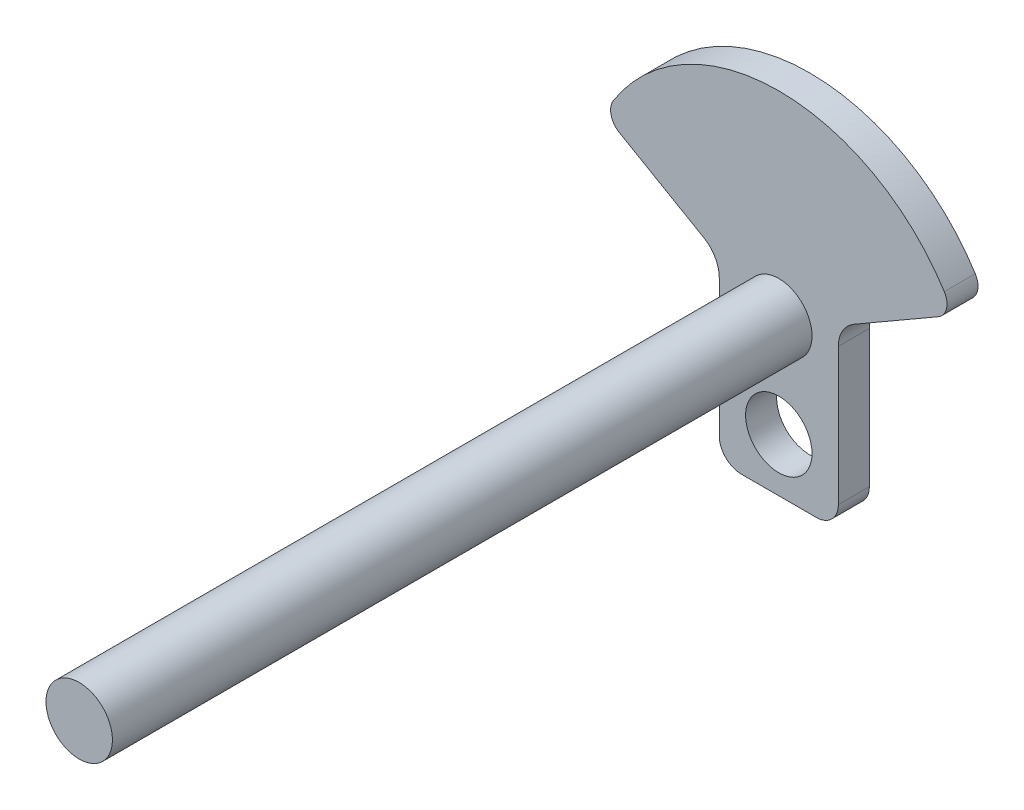
ISO-10303-21;
HEADER;
FILE_DESCRIPTION(('STEP AP214'),'2;1');
FILE_NAME('part.step','',(''),(''),'','','');
FILE_SCHEMA(('AUTOMOTIVE_DESIGN { 1 0 10303 214 1 1 1 1 }'));
ENDSEC;
DATA;
#1=APPLICATION_CONTEXT('core data for automotive mechanical design processes');
#2=APPLICATION_PROTOCOL_DEFINITION('international standard','automotive_design',2000,#1);
#3=PRODUCT_CONTEXT('',#1,'mechanical');
#4=PRODUCT('Part','Part','',(#3));
#5=PRODUCT_RELATED_PRODUCT_CATEGORY('part','',(#4));
#6=PRODUCT_DEFINITION_FORMATION('','',#4);
#7=PRODUCT_DEFINITION_CONTEXT('part definition',#1,'design');
#8=PRODUCT_DEFINITION('design','',#6,#7);
#9=PRODUCT_DEFINITION_SHAPE('','',#8);
#10=(LENGTH_UNIT() NAMED_UNIT(*) SI_UNIT(.MILLI.,.METRE.));
#11=(NAMED_UNIT(*) PLANE_ANGLE_UNIT() SI_UNIT($,.RADIAN.));
#12=(NAMED_UNIT(*) SI_UNIT($,.STERADIAN.) SOLID_ANGLE_UNIT());
#13=UNCERTAINTY_MEASURE_WITH_UNIT(LENGTH_MEASURE(1.E-05),#10,'distance_accuracy_value','');
#14=(GEOMETRIC_REPRESENTATION_CONTEXT(3) GLOBAL_UNCERTAINTY_ASSIGNED_CONTEXT((#13)) GLOBAL_UNIT_ASSIGNED_CONTEXT((#10,
#11,#12)) REPRESENTATION_CONTEXT('',''));
#15=CARTESIAN_POINT('',(0.,0.,0.));
#16=DIRECTION('',(0.,0.,1.));
#17=DIRECTION('',(1.,0.,0.));
#18=AXIS2_PLACEMENT_3D('',#15,#16,#17);
#19=CARTESIAN_POINT('',(33.8951098397121,35.9585481156726,7.));
#20=DIRECTION('',(0.,0.,1.));
#21=DIRECTION('',(1.,0.,0.));
#22=AXIS2_PLACEMENT_3D('',#19,#20,#21);
#23=PLANE('',#22);
#24=CARTESIAN_POINT('',(13.447554919856,35.,7.));
#25=DIRECTION('',(0.,0.,1.));
#26=DIRECTION('',(1.,0.,0.));
#27=AXIS2_PLACEMENT_3D('',#24,#25,#26);
#28=CIRCLE('',#27,7.50000000000001);
#29=CARTESIAN_POINT('',(20.947554919856,35.,7.));
#30=VERTEX_POINT('',#29);
#31=EDGE_CURVE('E243',#30,#30,#28,.T.);
#32=ORIENTED_EDGE('',*,*,#31,.F.);
#33=EDGE_LOOP('',(#32));
#34=FACE_BOUND('',#33,.T.);
#35=CARTESIAN_POINT('',(33.8951098397121,35.9585481156726,7.));
#36=DIRECTION('',(0.,0.,1.));
#37=DIRECTION('',(1.,0.,0.));
#38=AXIS2_PLACEMENT_3D('',#35,#36,#37);
#39=CIRCLE('',#38,7.00000000000001);
#40=CARTESIAN_POINT('',(30.395109839712,42.0207259421637,7.));
#41=VERTEX_POINT('',#40);
#42=CARTESIAN_POINT('',(26.8951098397121,35.9585481156727,7.));
#43=VERTEX_POINT('',#42);
#44=EDGE_CURVE('E269',#41,#43,#39,.T.);
#45=ORIENTED_EDGE('',*,*,#44,.F.);
#46=DIRECTION('',(0.866025403784434,0.500000000000008,0.));
#47=VECTOR('',#46,1.);
#48=CARTESIAN_POINT('',(30.395109839712,42.0207259421637,7.));
#49=LINE('',#48,#47);
#50=CARTESIAN_POINT('',(49.4401305831722,53.0163737951227,7.));
#51=VERTEX_POINT('',#50);
#52=EDGE_CURVE('E228',#41,#51,#49,.T.);
#53=ORIENTED_EDGE('',*,*,#52,.T.);
#54=CARTESIAN_POINT('',(47.4401305831722,56.4804754102603,7.));
#55=DIRECTION('',(0.,0.,-1.));
#56=DIRECTION('',(-1.,0.,0.));
#57=AXIS2_PLACEMENT_3D('',#54,#55,#56);
#58=CIRCLE('',#57,3.99999999999993);
#59=CARTESIAN_POINT('',(50.8215704971485,58.6172636796421,7.));
#60=VERTEX_POINT('',#59);
#61=EDGE_CURVE('E216',#60,#51,#58,.T.);
#62=ORIENTED_EDGE('',*,*,#61,.F.);
#63=CARTESIAN_POINT('',(13.447554919856,35.,7.));
#64=DIRECTION('',(0.,0.,-1.));
#65=DIRECTION('',(-1.,0.,0.));
#66=AXIS2_PLACEMENT_3D('',#63,#64,#65);
#67=CIRCLE('',#66,44.2107700010467);
#68=CARTESIAN_POINT('',(-23.9264606574367,58.6172636796418,7.));
#69=VERTEX_POINT('',#68);
#70=EDGE_CURVE('E227',#69,#60,#67,.T.);
#71=ORIENTED_EDGE('',*,*,#70,.F.);
#72=CARTESIAN_POINT('',(-20.5450207434603,56.4804754102601,7.));
#73=DIRECTION('',(0.,0.,1.));
#74=DIRECTION('',(1.,0.,0.));
#75=AXIS2_PLACEMENT_3D('',#72,#73,#74);
#76=CIRCLE('',#75,4.);
#77=CARTESIAN_POINT('',(-22.5450207434603,53.0163737951224,7.));
#78=VERTEX_POINT('',#77);
#79=EDGE_CURVE('E232',#69,#78,#76,.T.);
#80=ORIENTED_EDGE('',*,*,#79,.T.);
#81=DIRECTION('',(-0.86602540378444,0.499999999999998,0.));
#82=VECTOR('',#81,1.);
#83=CARTESIAN_POINT('',(-3.50000000000002,42.0207259421637,7.));
#84=LINE('',#83,#82);
#85=CARTESIAN_POINT('',(-3.50000000000002,42.0207259421637,7.));
#86=VERTEX_POINT('',#85);
#87=EDGE_CURVE('E234',#86,#78,#84,.T.);
#88=ORIENTED_EDGE('',*,*,#87,.F.);
#89=CARTESIAN_POINT('',(-7.,35.9585481156726,7.));
#90=DIRECTION('',(0.,0.,1.));
#91=DIRECTION('',(1.,0.,0.));
#92=AXIS2_PLACEMENT_3D('',#89,#90,#91);
#93=CIRCLE('',#92,7.);
#94=CARTESIAN_POINT('',(0.,35.9585481156726,7.));
#95=VERTEX_POINT('',#94);
#96=EDGE_CURVE('E311',#95,#86,#93,.T.);
#97=ORIENTED_EDGE('',*,*,#96,.F.);
#98=DIRECTION('',(0.,1.,0.));
#99=VECTOR('',#98,1.);
#100=CARTESIAN_POINT('',(0.,5.00000000000004,7.));
#101=LINE('',#100,#99);
#102=CARTESIAN_POINT('',(0.,5.00000000000004,7.));
#103=VERTEX_POINT('',#102);
#104=EDGE_CURVE('E308',#103,#95,#101,.T.);
#105=ORIENTED_EDGE('',*,*,#104,.F.);
#106=CARTESIAN_POINT('',(5.,5.,7.));
#107=DIRECTION('',(0.,0.,-1.));
#108=DIRECTION('',(-1.,0.,0.));
#109=AXIS2_PLACEMENT_3D('',#106,#107,#108);
#110=CIRCLE('',#109,5.);
#111=CARTESIAN_POINT('',(5.00000000000004,0.,7.));
#112=VERTEX_POINT('',#111);
#113=EDGE_CURVE('E305',#112,#103,#110,.T.);
#114=ORIENTED_EDGE('',*,*,#113,.F.);
#115=DIRECTION('',(1.,0.,0.));
#116=VECTOR('',#115,1.);
#117=CARTESIAN_POINT('',(5.00000000000004,0.,7.));
#118=LINE('',#117,#116);
#119=CARTESIAN_POINT('',(21.895109839712,0.,7.));
#120=VERTEX_POINT('',#119);
#121=EDGE_CURVE('E303',#112,#120,#118,.T.);
#122=ORIENTED_EDGE('',*,*,#121,.T.);
#123=CARTESIAN_POINT('',(21.8951098397121,5.,7.));
#124=DIRECTION('',(0.,0.,1.));
#125=DIRECTION('',(1.,0.,0.));
#126=AXIS2_PLACEMENT_3D('',#123,#124,#125);
#127=CIRCLE('',#126,5.);
#128=CARTESIAN_POINT('',(26.8951098397121,5.,7.));
#129=VERTEX_POINT('',#128);
#130=EDGE_CURVE('E297',#120,#129,#127,.T.);
#131=ORIENTED_EDGE('',*,*,#130,.T.);
#132=DIRECTION('',(0.,1.,0.));
#133=VECTOR('',#132,1.);
#134=CARTESIAN_POINT('',(26.8951098397121,5.00000000000004,7.));
#135=LINE('',#134,#133);
#136=EDGE_CURVE('E188',#129,#43,#135,.T.);
#137=ORIENTED_EDGE('',*,*,#136,.T.);
#138=EDGE_LOOP('',(#45,#53,#62,#71,#80,#88,#97,#105,#114,#122,#131,#137));
#139=FACE_BOUND('',#138,.T.);
#140=CARTESIAN_POINT('',(13.447554919856,12.,7.));
#141=DIRECTION('',(0.,0.,1.));
#142=DIRECTION('',(1.,0.,0.));
#143=AXIS2_PLACEMENT_3D('',#140,#141,#142);
#144=CIRCLE('',#143,7.5);
#145=CARTESIAN_POINT('',(20.947554919856,12.,7.));
#146=VERTEX_POINT('',#145);
#147=EDGE_CURVE('E476',#146,#146,#144,.T.);
#148=ORIENTED_EDGE('',*,*,#147,.F.);
#149=EDGE_LOOP('',(#148));
#150=FACE_BOUND('',#149,.T.);
#151=ADVANCED_FACE('F118',(#34,#139,#150),#23,.T.);
#152=CARTESIAN_POINT('',(33.8951098397121,35.9585481156726,0.));
#153=DIRECTION('',(0.,0.,1.));
#154=DIRECTION('',(1.,0.,0.));
#155=AXIS2_PLACEMENT_3D('',#152,#153,#154);
#156=PLANE('',#155);
#157=CARTESIAN_POINT('',(33.8951098397121,35.9585481156726,0.));
#158=DIRECTION('',(0.,0.,1.));
#159=DIRECTION('',(1.,0.,0.));
#160=AXIS2_PLACEMENT_3D('',#157,#158,#159);
#161=CIRCLE('',#160,7.00000000000001);
#162=CARTESIAN_POINT('',(30.395109839712,42.0207259421637,0.));
#163=VERTEX_POINT('',#162);
#164=CARTESIAN_POINT('',(26.8951098397121,35.9585481156727,0.));
#165=VERTEX_POINT('',#164);
#166=EDGE_CURVE('E239',#163,#165,#161,.T.);
#167=ORIENTED_EDGE('',*,*,#166,.T.);
#168=DIRECTION('',(0.,1.,0.));
#169=VECTOR('',#168,1.);
#170=CARTESIAN_POINT('',(26.8951098397121,5.00000000000004,0.));
#171=LINE('',#170,#169);
#172=CARTESIAN_POINT('',(26.8951098397121,5.,0.));
#173=VERTEX_POINT('',#172);
#174=EDGE_CURVE('E242',#173,#165,#171,.T.);
#175=ORIENTED_EDGE('',*,*,#174,.F.);
#176=CARTESIAN_POINT('',(21.8951098397121,5.,0.));
#177=DIRECTION('',(0.,0.,1.));
#178=DIRECTION('',(1.,0.,0.));
#179=AXIS2_PLACEMENT_3D('',#176,#177,#178);
#180=CIRCLE('',#179,5.);
#181=CARTESIAN_POINT('',(21.895109839712,0.,0.));
#182=VERTEX_POINT('',#181);
#183=EDGE_CURVE('E246',#182,#173,#180,.T.);
#184=ORIENTED_EDGE('',*,*,#183,.F.);
#185=DIRECTION('',(1.,0.,0.));
#186=VECTOR('',#185,1.);
#187=CARTESIAN_POINT('',(5.00000000000004,0.,0.));
#188=LINE('',#187,#186);
#189=CARTESIAN_POINT('',(5.00000000000004,0.,0.));
#190=VERTEX_POINT('',#189);
#191=EDGE_CURVE('E248',#190,#182,#188,.T.);
#192=ORIENTED_EDGE('',*,*,#191,.F.);
#193=CARTESIAN_POINT('',(5.,5.,0.));
#194=DIRECTION('',(0.,0.,-1.));
#195=DIRECTION('',(-1.,0.,0.));
#196=AXIS2_PLACEMENT_3D('',#193,#194,#195);
#197=CIRCLE('',#196,5.);
#198=CARTESIAN_POINT('',(0.,5.00000000000004,0.));
#199=VERTEX_POINT('',#198);
#200=EDGE_CURVE('E250',#190,#199,#197,.T.);
#201=ORIENTED_EDGE('',*,*,#200,.T.);
#202=DIRECTION('',(0.,1.,0.));
#203=VECTOR('',#202,1.);
#204=CARTESIAN_POINT('',(0.,5.00000000000004,0.));
#205=LINE('',#204,#203);
#206=CARTESIAN_POINT('',(0.,35.9585481156726,0.));
#207=VERTEX_POINT('',#206);
#208=EDGE_CURVE('E253',#199,#207,#205,.T.);
#209=ORIENTED_EDGE('',*,*,#208,.T.);
#210=CARTESIAN_POINT('',(-7.,35.9585481156726,0.));
#211=DIRECTION('',(0.,0.,1.));
#212=DIRECTION('',(1.,0.,0.));
#213=AXIS2_PLACEMENT_3D('',#210,#211,#212);
#214=CIRCLE('',#213,7.);
#215=CARTESIAN_POINT('',(-3.50000000000002,42.0207259421637,0.));
#216=VERTEX_POINT('',#215);
#217=EDGE_CURVE('E256',#207,#216,#214,.T.);
#218=ORIENTED_EDGE('',*,*,#217,.T.);
#219=DIRECTION('',(-0.86602540378444,0.499999999999998,0.));
#220=VECTOR('',#219,1.);
#221=CARTESIAN_POINT('',(-3.50000000000002,42.0207259421637,0.));
#222=LINE('',#221,#220);
#223=CARTESIAN_POINT('',(-22.5450207434603,53.0163737951224,0.));
#224=VERTEX_POINT('',#223);
#225=EDGE_CURVE('E259',#216,#224,#222,.T.);
#226=ORIENTED_EDGE('',*,*,#225,.T.);
#227=CARTESIAN_POINT('',(-20.5450207434603,56.4804754102601,0.));
#228=DIRECTION('',(0.,0.,1.));
#229=DIRECTION('',(1.,0.,0.));
#230=AXIS2_PLACEMENT_3D('',#227,#228,#229);
#231=CIRCLE('',#230,4.);
#232=CARTESIAN_POINT('',(-23.9264606574367,58.6172636796418,0.));
#233=VERTEX_POINT('',#232);
#234=EDGE_CURVE('E262',#233,#224,#231,.T.);
#235=ORIENTED_EDGE('',*,*,#234,.F.);
#236=CARTESIAN_POINT('',(13.447554919856,35.,0.));
#237=DIRECTION('',(0.,0.,-1.));
#238=DIRECTION('',(-1.,0.,0.));
#239=AXIS2_PLACEMENT_3D('',#236,#237,#238);
#240=CIRCLE('',#239,44.2107700010467);
#241=CARTESIAN_POINT('',(50.8215704971485,58.6172636796421,0.));
#242=VERTEX_POINT('',#241);
#243=EDGE_CURVE('E265',#233,#242,#240,.T.);
#244=ORIENTED_EDGE('',*,*,#243,.T.);
#245=CARTESIAN_POINT('',(47.4401305831722,56.4804754102603,0.));
#246=DIRECTION('',(0.,0.,-1.));
#247=DIRECTION('',(-1.,0.,0.));
#248=AXIS2_PLACEMENT_3D('',#245,#246,#247);
#249=CIRCLE('',#248,3.99999999999993);
#250=CARTESIAN_POINT('',(49.4401305831722,53.0163737951227,0.));
#251=VERTEX_POINT('',#250);
#252=EDGE_CURVE('E218',#242,#251,#249,.T.);
#253=ORIENTED_EDGE('',*,*,#252,.T.);
#254=DIRECTION('',(0.866025403784434,0.500000000000008,0.));
#255=VECTOR('',#254,1.);
#256=CARTESIAN_POINT('',(30.395109839712,42.0207259421637,0.));
#257=LINE('',#256,#255);
#258=EDGE_CURVE('E268',#163,#251,#257,.T.);
#259=ORIENTED_EDGE('',*,*,#258,.F.);
#260=EDGE_LOOP('',(#167,#175,#184,#192,#201,#209,#218,#226,#235,#244,#253,#259));
#261=FACE_BOUND('',#260,.T.);
#262=CARTESIAN_POINT('',(13.447554919856,12.,0.));
#263=DIRECTION('',(0.,0.,1.));
#264=DIRECTION('',(1.,0.,0.));
#265=AXIS2_PLACEMENT_3D('',#262,#263,#264);
#266=CIRCLE('',#265,7.5);
#267=CARTESIAN_POINT('',(20.947554919856,12.,0.));
#268=VERTEX_POINT('',#267);
#269=EDGE_CURVE('E473',#268,#268,#266,.T.);
#270=ORIENTED_EDGE('',*,*,#269,.T.);
#271=EDGE_LOOP('',(#270));
#272=FACE_BOUND('',#271,.T.);
#273=ADVANCED_FACE('F293',(#261,#272),#156,.F.);
#274=CARTESIAN_POINT('',(33.8951098397121,35.9585481156726,7.));
#275=DIRECTION('',(0.,0.,-1.));
#276=DIRECTION('',(-1.,0.,0.));
#277=AXIS2_PLACEMENT_3D('',#274,#275,#276);
#278=CYLINDRICAL_SURFACE('',#277,7.00000000000001);
#279=ORIENTED_EDGE('',*,*,#166,.F.);
#280=DIRECTION('',(0.,0.,-1.));
#281=VECTOR('',#280,1.);
#282=CARTESIAN_POINT('',(30.395109839712,42.0207259421637,7.));
#283=LINE('',#282,#281);
#284=EDGE_CURVE('E12',#41,#163,#283,.T.);
#285=ORIENTED_EDGE('',*,*,#284,.F.);
#286=ORIENTED_EDGE('',*,*,#44,.T.);
#287=DIRECTION('',(0.,0.,-1.));
#288=VECTOR('',#287,1.);
#289=CARTESIAN_POINT('',(26.8951098397121,35.9585481156727,7.));
#290=LINE('',#289,#288);
#291=EDGE_CURVE('E122',#43,#165,#290,.T.);
#292=ORIENTED_EDGE('',*,*,#291,.T.);
#293=EDGE_LOOP('',(#279,#285,#286,#292));
#294=FACE_BOUND('',#293,.T.);
#295=ADVANCED_FACE('F120',(#294),#278,.F.);
#296=CARTESIAN_POINT('',(30.395109839712,42.0207259421637,7.));
#297=DIRECTION('',(-0.500000000000008,0.866025403784434,0.));
#298=DIRECTION('',(-0.866025403784434,-0.500000000000008,0.));
#299=AXIS2_PLACEMENT_3D('',#296,#297,#298);
#300=PLANE('',#299);
#301=ORIENTED_EDGE('',*,*,#258,.T.);
#302=DIRECTION('',(0.,0.,-1.));
#303=VECTOR('',#302,1.);
#304=CARTESIAN_POINT('',(49.4401305831722,53.0163737951227,7.));
#305=LINE('',#304,#303);
#306=EDGE_CURVE('E128',#51,#251,#305,.T.);
#307=ORIENTED_EDGE('',*,*,#306,.F.);
#308=ORIENTED_EDGE('',*,*,#52,.F.);
#309=ORIENTED_EDGE('',*,*,#284,.T.);
#310=EDGE_LOOP('',(#301,#307,#308,#309));
#311=FACE_BOUND('',#310,.T.);
#312=ADVANCED_FACE('F295',(#311),#300,.F.);
#313=CARTESIAN_POINT('',(47.4401305831722,56.4804754102603,7.));
#314=DIRECTION('',(0.,0.,-1.));
#315=DIRECTION('',(-1.,0.,0.));
#316=AXIS2_PLACEMENT_3D('',#313,#314,#315);
#317=CYLINDRICAL_SURFACE('',#316,3.99999999999993);
#318=ORIENTED_EDGE('',*,*,#252,.F.);
#319=DIRECTION('',(0.,0.,-1.));
#320=VECTOR('',#319,1.);
#321=CARTESIAN_POINT('',(50.8215704971485,58.6172636796421,7.));
#322=LINE('',#321,#320);
#323=EDGE_CURVE('E213',#60,#242,#322,.T.);
#324=ORIENTED_EDGE('',*,*,#323,.F.);
#325=ORIENTED_EDGE('',*,*,#61,.T.);
#326=ORIENTED_EDGE('',*,*,#306,.T.);
#327=EDGE_LOOP('',(#318,#324,#325,#326));
#328=FACE_BOUND('',#327,.T.);
#329=ADVANCED_FACE('F215',(#328),#317,.T.);
#330=CARTESIAN_POINT('',(13.447554919856,35.,7.));
#331=DIRECTION('',(0.,0.,-1.));
#332=DIRECTION('',(-1.,0.,0.));
#333=AXIS2_PLACEMENT_3D('',#330,#331,#332);
#334=CYLINDRICAL_SURFACE('',#333,44.2107700010467);
#335=ORIENTED_EDGE('',*,*,#243,.F.);
#336=DIRECTION('',(0.,0.,-1.));
#337=VECTOR('',#336,1.);
#338=CARTESIAN_POINT('',(-23.9264606574367,58.6172636796418,7.));
#339=LINE('',#338,#337);
#340=EDGE_CURVE('E223',#69,#233,#339,.T.);
#341=ORIENTED_EDGE('',*,*,#340,.F.);
#342=ORIENTED_EDGE('',*,*,#70,.T.);
#343=ORIENTED_EDGE('',*,*,#323,.T.);
#344=EDGE_LOOP('',(#335,#341,#342,#343));
#345=FACE_BOUND('',#344,.T.);
#346=ADVANCED_FACE('F230',(#345),#334,.T.);
#347=CARTESIAN_POINT('',(-20.5450207434603,56.4804754102601,7.));
#348=DIRECTION('',(0.,0.,-1.));
#349=DIRECTION('',(-1.,0.,0.));
#350=AXIS2_PLACEMENT_3D('',#347,#348,#349);
#351=CYLINDRICAL_SURFACE('',#350,4.);
#352=ORIENTED_EDGE('',*,*,#234,.T.);
#353=DIRECTION('',(0.,0.,-1.));
#354=VECTOR('',#353,1.);
#355=CARTESIAN_POINT('',(-22.5450207434603,53.0163737951224,7.));
#356=LINE('',#355,#354);
#357=EDGE_CURVE('E273',#78,#224,#356,.T.);
#358=ORIENTED_EDGE('',*,*,#357,.F.);
#359=ORIENTED_EDGE('',*,*,#79,.F.);
#360=ORIENTED_EDGE('',*,*,#340,.T.);
#361=EDGE_LOOP('',(#352,#358,#359,#360));
#362=FACE_BOUND('',#361,.T.);
#363=ADVANCED_FACE('F341',(#362),#351,.T.);
#364=CARTESIAN_POINT('',(-3.50000000000002,42.0207259421637,7.));
#365=DIRECTION('',(-0.499999999999998,-0.86602540378444,0.));
#366=DIRECTION('',(0.86602540378444,-0.499999999999998,0.));
#367=AXIS2_PLACEMENT_3D('',#364,#365,#366);
#368=PLANE('',#367);
#369=ORIENTED_EDGE('',*,*,#225,.F.);
#370=DIRECTION('',(0.,0.,-1.));
#371=VECTOR('',#370,1.);
#372=CARTESIAN_POINT('',(-3.50000000000002,42.0207259421637,7.));
#373=LINE('',#372,#371);
#374=EDGE_CURVE('E275',#86,#216,#373,.T.);
#375=ORIENTED_EDGE('',*,*,#374,.F.);
#376=ORIENTED_EDGE('',*,*,#87,.T.);
#377=ORIENTED_EDGE('',*,*,#357,.T.);
#378=EDGE_LOOP('',(#369,#375,#376,#377));
#379=FACE_BOUND('',#378,.T.);
#380=ADVANCED_FACE('F317',(#379),#368,.T.);
#381=CARTESIAN_POINT('',(-7.,35.9585481156726,7.));
#382=DIRECTION('',(0.,0.,-1.));
#383=DIRECTION('',(-1.,0.,0.));
#384=AXIS2_PLACEMENT_3D('',#381,#382,#383);
#385=CYLINDRICAL_SURFACE('',#384,7.);
#386=ORIENTED_EDGE('',*,*,#217,.F.);
#387=DIRECTION('',(0.,0.,-1.));
#388=VECTOR('',#387,1.);
#389=CARTESIAN_POINT('',(0.,35.9585481156726,7.));
#390=LINE('',#389,#388);
#391=EDGE_CURVE('E277',#95,#207,#390,.T.);
#392=ORIENTED_EDGE('',*,*,#391,.F.);
#393=ORIENTED_EDGE('',*,*,#96,.T.);
#394=ORIENTED_EDGE('',*,*,#374,.T.);
#395=EDGE_LOOP('',(#386,#392,#393,#394));
#396=FACE_BOUND('',#395,.T.);
#397=ADVANCED_FACE('F323',(#396),#385,.F.);
#398=CARTESIAN_POINT('',(0.,5.00000000000004,7.));
#399=DIRECTION('',(-1.,0.,0.));
#400=DIRECTION('',(0.,0.,1.));
#401=AXIS2_PLACEMENT_3D('',#398,#399,#400);
#402=PLANE('',#401);
#403=ORIENTED_EDGE('',*,*,#208,.F.);
#404=DIRECTION('',(0.,0.,-1.));
#405=VECTOR('',#404,1.);
#406=CARTESIAN_POINT('',(0.,5.00000000000004,7.));
#407=LINE('',#406,#405);
#408=EDGE_CURVE('E279',#103,#199,#407,.T.);
#409=ORIENTED_EDGE('',*,*,#408,.F.);
#410=ORIENTED_EDGE('',*,*,#104,.T.);
#411=ORIENTED_EDGE('',*,*,#391,.T.);
#412=EDGE_LOOP('',(#403,#409,#410,#411));
#413=FACE_BOUND('',#412,.T.);
#414=ADVANCED_FACE('F326',(#413),#402,.T.);
#415=CARTESIAN_POINT('',(5.,5.,7.));
#416=DIRECTION('',(0.,0.,-1.));
#417=DIRECTION('',(-1.,0.,0.));
#418=AXIS2_PLACEMENT_3D('',#415,#416,#417);
#419=CYLINDRICAL_SURFACE('',#418,5.);
#420=ORIENTED_EDGE('',*,*,#200,.F.);
#421=DIRECTION('',(0.,0.,-1.));
#422=VECTOR('',#421,1.);
#423=CARTESIAN_POINT('',(5.00000000000004,0.,7.));
#424=LINE('',#423,#422);
#425=EDGE_CURVE('E281',#112,#190,#424,.T.);
#426=ORIENTED_EDGE('',*,*,#425,.F.);
#427=ORIENTED_EDGE('',*,*,#113,.T.);
#428=ORIENTED_EDGE('',*,*,#408,.T.);
#429=EDGE_LOOP('',(#420,#426,#427,#428));
#430=FACE_BOUND('',#429,.T.);
#431=ADVANCED_FACE('F330',(#430),#419,.T.);
#432=CARTESIAN_POINT('',(5.00000000000004,0.,7.));
#433=DIRECTION('',(0.,1.,0.));
#434=DIRECTION('',(0.,0.,1.));
#435=AXIS2_PLACEMENT_3D('',#432,#433,#434);
#436=PLANE('',#435);
#437=ORIENTED_EDGE('',*,*,#191,.T.);
#438=DIRECTION('',(0.,0.,-1.));
#439=VECTOR('',#438,1.);
#440=CARTESIAN_POINT('',(21.895109839712,0.,7.));
#441=LINE('',#440,#439);
#442=EDGE_CURVE('E283',#120,#182,#441,.T.);
#443=ORIENTED_EDGE('',*,*,#442,.F.);
#444=ORIENTED_EDGE('',*,*,#121,.F.);
#445=ORIENTED_EDGE('',*,*,#425,.T.);
#446=EDGE_LOOP('',(#437,#443,#444,#445));
#447=FACE_BOUND('',#446,.T.);
#448=ADVANCED_FACE('F335',(#447),#436,.F.);
#449=CARTESIAN_POINT('',(21.8951098397121,5.,7.));
#450=DIRECTION('',(0.,0.,-1.));
#451=DIRECTION('',(-1.,0.,0.));
#452=AXIS2_PLACEMENT_3D('',#449,#450,#451);
#453=CYLINDRICAL_SURFACE('',#452,5.);
#454=ORIENTED_EDGE('',*,*,#183,.T.);
#455=DIRECTION('',(0.,0.,-1.));
#456=VECTOR('',#455,1.);
#457=CARTESIAN_POINT('',(26.8951098397121,5.,7.));
#458=LINE('',#457,#456);
#459=EDGE_CURVE('E285',#129,#173,#458,.T.);
#460=ORIENTED_EDGE('',*,*,#459,.F.);
#461=ORIENTED_EDGE('',*,*,#130,.F.);
#462=ORIENTED_EDGE('',*,*,#442,.T.);
#463=EDGE_LOOP('',(#454,#460,#461,#462));
#464=FACE_BOUND('',#463,.T.);
#465=ADVANCED_FACE('F338',(#464),#453,.T.);
#466=CARTESIAN_POINT('',(26.8951098397121,5.00000000000004,7.));
#467=DIRECTION('',(-1.,0.,0.));
#468=DIRECTION('',(0.,-1.,0.));
#469=AXIS2_PLACEMENT_3D('',#466,#467,#468);
#470=PLANE('',#469);
#471=ORIENTED_EDGE('',*,*,#174,.T.);
#472=ORIENTED_EDGE('',*,*,#291,.F.);
#473=ORIENTED_EDGE('',*,*,#136,.F.);
#474=ORIENTED_EDGE('',*,*,#459,.T.);
#475=EDGE_LOOP('',(#471,#472,#473,#474));
#476=FACE_BOUND('',#475,.T.);
#477=ADVANCED_FACE('F290',(#476),#470,.F.);
#478=CARTESIAN_POINT('',(13.447554919856,12.,7.));
#479=DIRECTION('',(0.,0.,-1.));
#480=DIRECTION('',(-1.,0.,0.));
#481=AXIS2_PLACEMENT_3D('',#478,#479,#480);
#482=CYLINDRICAL_SURFACE('',#481,7.5);
#483=ORIENTED_EDGE('',*,*,#147,.T.);
#484=EDGE_LOOP('',(#483));
#485=FACE_BOUND('',#484,.T.);
#486=ORIENTED_EDGE('',*,*,#269,.F.);
#487=EDGE_LOOP('',(#486));
#488=FACE_BOUND('',#487,.T.);
#489=ADVANCED_FACE('F359',(#485,#488),#482,.F.);
#490=CARTESIAN_POINT('',(13.447554919856,35.,165.));
#491=DIRECTION('',(0.,0.,-1.));
#492=DIRECTION('',(-1.,0.,0.));
#493=AXIS2_PLACEMENT_3D('',#490,#491,#492);
#494=CYLINDRICAL_SURFACE('',#493,7.50000000000002);
#495=ORIENTED_EDGE('',*,*,#31,.T.);
#496=EDGE_LOOP('',(#495));
#497=FACE_BOUND('',#496,.T.);
#498=CARTESIAN_POINT('',(13.447554919856,35.,165.));
#499=DIRECTION('',(0.,0.,-1.));
#500=DIRECTION('',(-1.,0.,0.));
#501=AXIS2_PLACEMENT_3D('',#498,#499,#500);
#502=CIRCLE('',#501,7.50000000000002);
#503=CARTESIAN_POINT('',(5.94755491985601,35.,165.));
#504=VERTEX_POINT('',#503);
#505=EDGE_CURVE('E471',#504,#504,#502,.T.);
#506=ORIENTED_EDGE('',*,*,#505,.T.);
#507=EDGE_LOOP('',(#506));
#508=FACE_BOUND('',#507,.T.);
#509=ADVANCED_FACE('F440',(#497,#508),#494,.T.);
#510=CARTESIAN_POINT('',(13.447554919856,35.,165.));
#511=DIRECTION('',(0.,0.,-1.));
#512=DIRECTION('',(-1.,0.,0.));
#513=AXIS2_PLACEMENT_3D('',#510,#511,#512);
#514=PLANE('',#513);
#515=ORIENTED_EDGE('',*,*,#505,.F.);
#516=EDGE_LOOP('',(#515));
#517=FACE_BOUND('',#516,.T.);
#518=ADVANCED_FACE('F456',(#517),#514,.F.);
#519=CLOSED_SHELL('',(#151,#273,#295,#312,#329,#346,#363,#380,#397,#414,#431,#448,#465,#477,
#489,#509,#518));
#520=MANIFOLD_SOLID_BREP('B2',#519);
#521=ADVANCED_BREP_SHAPE_REPRESENTATION('',(#18,#520),#14);
#522=SHAPE_DEFINITION_REPRESENTATION(#9,#521);
ENDSEC;
END-ISO-10303-21;
